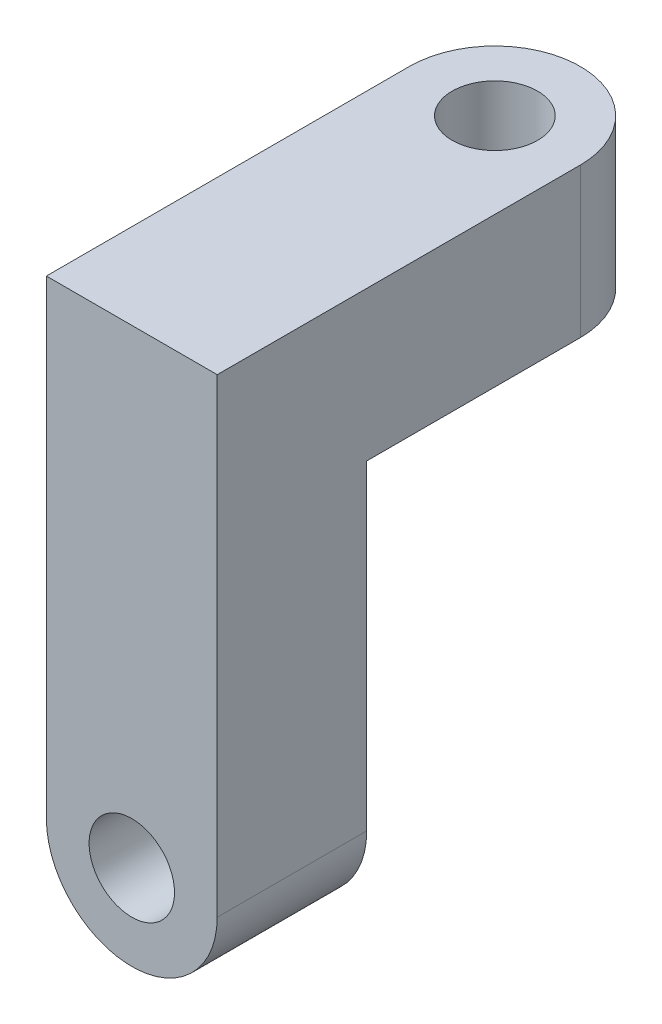
ISO-10303-21;
HEADER;
FILE_DESCRIPTION(('STEP AP214'),'2;1');
FILE_NAME('part.step','',(''),(''),'','','');
FILE_SCHEMA(('AUTOMOTIVE_DESIGN { 1 0 10303 214 1 1 1 1 }'));
ENDSEC;
DATA;
#1=APPLICATION_CONTEXT('core data for automotive mechanical design processes');
#2=APPLICATION_PROTOCOL_DEFINITION('international standard','automotive_design',2000,#1);
#3=PRODUCT_CONTEXT('',#1,'mechanical');
#4=PRODUCT('Part','Part','',(#3));
#5=PRODUCT_RELATED_PRODUCT_CATEGORY('part','',(#4));
#6=PRODUCT_DEFINITION_FORMATION('','',#4);
#7=PRODUCT_DEFINITION_CONTEXT('part definition',#1,'design');
#8=PRODUCT_DEFINITION('design','',#6,#7);
#9=PRODUCT_DEFINITION_SHAPE('','',#8);
#10=(LENGTH_UNIT() NAMED_UNIT(*) SI_UNIT(.MILLI.,.METRE.));
#11=(NAMED_UNIT(*) PLANE_ANGLE_UNIT() SI_UNIT($,.RADIAN.));
#12=(NAMED_UNIT(*) SI_UNIT($,.STERADIAN.) SOLID_ANGLE_UNIT());
#13=UNCERTAINTY_MEASURE_WITH_UNIT(LENGTH_MEASURE(1.E-05),#10,'distance_accuracy_value','');
#14=(GEOMETRIC_REPRESENTATION_CONTEXT(3) GLOBAL_UNCERTAINTY_ASSIGNED_CONTEXT((#13)) GLOBAL_UNIT_ASSIGNED_CONTEXT((#10,
#11,#12)) REPRESENTATION_CONTEXT('',''));
#15=CARTESIAN_POINT('',(0.,0.,0.));
#16=DIRECTION('',(0.,0.,1.));
#17=DIRECTION('',(1.,0.,0.));
#18=AXIS2_PLACEMENT_3D('',#15,#16,#17);
#19=CARTESIAN_POINT('',(0.,-15.,7.));
#20=DIRECTION('',(0.,0.,1.));
#21=DIRECTION('',(1.,0.,0.));
#22=AXIS2_PLACEMENT_3D('',#19,#20,#21);
#23=PLANE('',#22);
#24=CARTESIAN_POINT('',(0.,-15.,7.));
#25=DIRECTION('',(0.,0.,1.));
#26=DIRECTION('',(1.,0.,0.));
#27=AXIS2_PLACEMENT_3D('',#24,#25,#26);
#28=CIRCLE('',#27,2.);
#29=CARTESIAN_POINT('',(2.,-15.,7.));
#30=VERTEX_POINT('',#29);
#31=EDGE_CURVE('E153',#30,#30,#28,.T.);
#32=ORIENTED_EDGE('',*,*,#31,.F.);
#33=EDGE_LOOP('',(#32));
#34=FACE_BOUND('',#33,.T.);
#35=CARTESIAN_POINT('',(0.,-15.,7.));
#36=DIRECTION('',(0.,0.,1.));
#37=DIRECTION('',(1.,0.,0.));
#38=AXIS2_PLACEMENT_3D('',#35,#36,#37);
#39=CIRCLE('',#38,4.);
#40=CARTESIAN_POINT('',(-4.,-15.,7.));
#41=VERTEX_POINT('',#40);
#42=CARTESIAN_POINT('',(4.,-15.,7.));
#43=VERTEX_POINT('',#42);
#44=EDGE_CURVE('E80',#41,#43,#39,.T.);
#45=ORIENTED_EDGE('',*,*,#44,.T.);
#46=DIRECTION('',(0.,1.,0.));
#47=VECTOR('',#46,1.);
#48=CARTESIAN_POINT('',(4.,0.,7.));
#49=LINE('',#48,#47);
#50=CARTESIAN_POINT('',(4.,7.,7.));
#51=VERTEX_POINT('',#50);
#52=EDGE_CURVE('E145',#43,#51,#49,.T.);
#53=ORIENTED_EDGE('',*,*,#52,.T.);
#54=DIRECTION('',(1.,0.,0.));
#55=VECTOR('',#54,1.);
#56=CARTESIAN_POINT('',(0.,7.,7.));
#57=LINE('',#56,#55);
#58=CARTESIAN_POINT('',(-4.,7.,7.));
#59=VERTEX_POINT('',#58);
#60=EDGE_CURVE('E134',#59,#51,#57,.T.);
#61=ORIENTED_EDGE('',*,*,#60,.F.);
#62=DIRECTION('',(0.,-1.,0.));
#63=VECTOR('',#62,1.);
#64=CARTESIAN_POINT('',(-4.,-15.,7.));
#65=LINE('',#64,#63);
#66=EDGE_CURVE('E51',#59,#41,#65,.T.);
#67=ORIENTED_EDGE('',*,*,#66,.T.);
#68=EDGE_LOOP('',(#45,#53,#61,#67));
#69=FACE_BOUND('',#68,.T.);
#70=ADVANCED_FACE('F33',(#34,#69),#23,.T.);
#71=CARTESIAN_POINT('',(0.,-15.,0.));
#72=DIRECTION('',(0.,0.,1.));
#73=DIRECTION('',(1.,0.,0.));
#74=AXIS2_PLACEMENT_3D('',#71,#72,#73);
#75=PLANE('',#74);
#76=CARTESIAN_POINT('',(0.,-15.,0.));
#77=DIRECTION('',(0.,0.,1.));
#78=DIRECTION('',(1.,0.,0.));
#79=AXIS2_PLACEMENT_3D('',#76,#77,#78);
#80=CIRCLE('',#79,2.);
#81=CARTESIAN_POINT('',(2.,-15.,0.));
#82=VERTEX_POINT('',#81);
#83=EDGE_CURVE('E37',#82,#82,#80,.T.);
#84=ORIENTED_EDGE('',*,*,#83,.T.);
#85=EDGE_LOOP('',(#84));
#86=FACE_BOUND('',#85,.T.);
#87=CARTESIAN_POINT('',(0.,-15.,0.));
#88=DIRECTION('',(0.,0.,1.));
#89=DIRECTION('',(1.,0.,0.));
#90=AXIS2_PLACEMENT_3D('',#87,#88,#89);
#91=CIRCLE('',#90,4.);
#92=CARTESIAN_POINT('',(-4.,-15.,0.));
#93=VERTEX_POINT('',#92);
#94=CARTESIAN_POINT('',(4.,-15.,0.));
#95=VERTEX_POINT('',#94);
#96=EDGE_CURVE('E86',#93,#95,#91,.T.);
#97=ORIENTED_EDGE('',*,*,#96,.F.);
#98=DIRECTION('',(0.,-1.,0.));
#99=VECTOR('',#98,1.);
#100=CARTESIAN_POINT('',(-4.,-15.,0.));
#101=LINE('',#100,#99);
#102=CARTESIAN_POINT('',(-4.,0.,0.));
#103=VERTEX_POINT('',#102);
#104=EDGE_CURVE('E70',#103,#93,#101,.T.);
#105=ORIENTED_EDGE('',*,*,#104,.F.);
#106=DIRECTION('',(-1.,0.,0.));
#107=VECTOR('',#106,1.);
#108=CARTESIAN_POINT('',(-4.,0.,0.));
#109=LINE('',#108,#107);
#110=CARTESIAN_POINT('',(4.,0.,0.));
#111=VERTEX_POINT('',#110);
#112=EDGE_CURVE('E81',#111,#103,#109,.T.);
#113=ORIENTED_EDGE('',*,*,#112,.F.);
#114=DIRECTION('',(0.,1.,0.));
#115=VECTOR('',#114,1.);
#116=CARTESIAN_POINT('',(4.,0.,0.));
#117=LINE('',#116,#115);
#118=EDGE_CURVE('E64',#95,#111,#117,.T.);
#119=ORIENTED_EDGE('',*,*,#118,.F.);
#120=EDGE_LOOP('',(#97,#105,#113,#119));
#121=FACE_BOUND('',#120,.T.);
#122=ADVANCED_FACE('F88',(#86,#121),#75,.F.);
#123=CARTESIAN_POINT('',(0.,-15.,7.));
#124=DIRECTION('',(0.,0.,-1.));
#125=DIRECTION('',(-1.,0.,0.));
#126=AXIS2_PLACEMENT_3D('',#123,#124,#125);
#127=CYLINDRICAL_SURFACE('',#126,4.);
#128=ORIENTED_EDGE('',*,*,#96,.T.);
#129=DIRECTION('',(0.,0.,-1.));
#130=VECTOR('',#129,1.);
#131=CARTESIAN_POINT('',(4.,-15.,7.));
#132=LINE('',#131,#130);
#133=EDGE_CURVE('E11',#43,#95,#132,.T.);
#134=ORIENTED_EDGE('',*,*,#133,.F.);
#135=ORIENTED_EDGE('',*,*,#44,.F.);
#136=DIRECTION('',(0.,0.,-1.));
#137=VECTOR('',#136,1.);
#138=CARTESIAN_POINT('',(-4.,-15.,7.));
#139=LINE('',#138,#137);
#140=EDGE_CURVE('E43',#41,#93,#139,.T.);
#141=ORIENTED_EDGE('',*,*,#140,.T.);
#142=EDGE_LOOP('',(#128,#134,#135,#141));
#143=FACE_BOUND('',#142,.T.);
#144=ADVANCED_FACE('F35',(#143),#127,.T.);
#145=CARTESIAN_POINT('',(4.,0.,7.));
#146=DIRECTION('',(-1.,0.,0.));
#147=DIRECTION('',(0.,0.,1.));
#148=AXIS2_PLACEMENT_3D('',#145,#146,#147);
#149=PLANE('',#148);
#150=ORIENTED_EDGE('',*,*,#118,.T.);
#151=DIRECTION('',(0.,0.,-1.));
#152=VECTOR('',#151,1.);
#153=CARTESIAN_POINT('',(4.,0.,0.));
#154=LINE('',#153,#152);
#155=CARTESIAN_POINT('',(4.,0.,-10.));
#156=VERTEX_POINT('',#155);
#157=EDGE_CURVE('E103',#111,#156,#154,.T.);
#158=ORIENTED_EDGE('',*,*,#157,.T.);
#159=DIRECTION('',(0.,-1.,0.));
#160=VECTOR('',#159,1.);
#161=CARTESIAN_POINT('',(4.,7.,-10.));
#162=LINE('',#161,#160);
#163=CARTESIAN_POINT('',(4.,7.,-10.));
#164=VERTEX_POINT('',#163);
#165=EDGE_CURVE('E89',#164,#156,#162,.T.);
#166=ORIENTED_EDGE('',*,*,#165,.F.);
#167=DIRECTION('',(0.,0.,-1.));
#168=VECTOR('',#167,1.);
#169=CARTESIAN_POINT('',(4.,7.,0.));
#170=LINE('',#169,#168);
#171=EDGE_CURVE('E129',#51,#164,#170,.T.);
#172=ORIENTED_EDGE('',*,*,#171,.F.);
#173=ORIENTED_EDGE('',*,*,#52,.F.);
#174=ORIENTED_EDGE('',*,*,#133,.T.);
#175=EDGE_LOOP('',(#150,#158,#166,#172,#173,#174));
#176=FACE_BOUND('',#175,.T.);
#177=ADVANCED_FACE('F136',(#176),#149,.F.);
#178=CARTESIAN_POINT('',(-4.,-15.,7.));
#179=DIRECTION('',(1.,0.,0.));
#180=DIRECTION('',(0.,0.,-1.));
#181=AXIS2_PLACEMENT_3D('',#178,#179,#180);
#182=PLANE('',#181);
#183=ORIENTED_EDGE('',*,*,#104,.T.);
#184=ORIENTED_EDGE('',*,*,#140,.F.);
#185=ORIENTED_EDGE('',*,*,#66,.F.);
#186=DIRECTION('',(0.,0.,1.));
#187=VECTOR('',#186,1.);
#188=CARTESIAN_POINT('',(-4.,7.,0.));
#189=LINE('',#188,#187);
#190=CARTESIAN_POINT('',(-4.,7.,-10.));
#191=VERTEX_POINT('',#190);
#192=EDGE_CURVE('E128',#191,#59,#189,.T.);
#193=ORIENTED_EDGE('',*,*,#192,.F.);
#194=DIRECTION('',(0.,-1.,0.));
#195=VECTOR('',#194,1.);
#196=CARTESIAN_POINT('',(-4.,7.,-10.));
#197=LINE('',#196,#195);
#198=CARTESIAN_POINT('',(-4.,0.,-10.));
#199=VERTEX_POINT('',#198);
#200=EDGE_CURVE('E93',#191,#199,#197,.T.);
#201=ORIENTED_EDGE('',*,*,#200,.T.);
#202=DIRECTION('',(0.,0.,1.));
#203=VECTOR('',#202,1.);
#204=CARTESIAN_POINT('',(-4.,0.,0.));
#205=LINE('',#204,#203);
#206=EDGE_CURVE('E76',#199,#103,#205,.T.);
#207=ORIENTED_EDGE('',*,*,#206,.T.);
#208=EDGE_LOOP('',(#183,#184,#185,#193,#201,#207));
#209=FACE_BOUND('',#208,.T.);
#210=ADVANCED_FACE('F72',(#209),#182,.F.);
#211=CARTESIAN_POINT('',(0.,0.,0.));
#212=DIRECTION('',(0.,1.,0.));
#213=DIRECTION('',(0.,0.,1.));
#214=AXIS2_PLACEMENT_3D('',#211,#212,#213);
#215=PLANE('',#214);
#216=CARTESIAN_POINT('',(0.,0.,-10.));
#217=DIRECTION('',(0.,1.,0.));
#218=DIRECTION('',(0.,0.,1.));
#219=AXIS2_PLACEMENT_3D('',#216,#217,#218);
#220=CIRCLE('',#219,2.);
#221=CARTESIAN_POINT('',(0.,0.,-8.));
#222=VERTEX_POINT('',#221);
#223=EDGE_CURVE('E138',#222,#222,#220,.T.);
#224=ORIENTED_EDGE('',*,*,#223,.T.);
#225=EDGE_LOOP('',(#224));
#226=FACE_BOUND('',#225,.T.);
#227=ORIENTED_EDGE('',*,*,#157,.F.);
#228=ORIENTED_EDGE('',*,*,#112,.T.);
#229=ORIENTED_EDGE('',*,*,#206,.F.);
#230=CARTESIAN_POINT('',(0.,0.,-10.));
#231=DIRECTION('',(0.,1.,0.));
#232=DIRECTION('',(0.,0.,1.));
#233=AXIS2_PLACEMENT_3D('',#230,#231,#232);
#234=CIRCLE('',#233,4.);
#235=EDGE_CURVE('E137',#156,#199,#234,.T.);
#236=ORIENTED_EDGE('',*,*,#235,.F.);
#237=EDGE_LOOP('',(#227,#228,#229,#236));
#238=FACE_BOUND('',#237,.T.);
#239=ADVANCED_FACE('F100',(#226,#238),#215,.F.);
#240=CARTESIAN_POINT('',(0.,7.,-10.));
#241=DIRECTION('',(0.,-1.,0.));
#242=DIRECTION('',(0.,0.,-1.));
#243=AXIS2_PLACEMENT_3D('',#240,#241,#242);
#244=CYLINDRICAL_SURFACE('',#243,4.);
#245=ORIENTED_EDGE('',*,*,#235,.T.);
#246=ORIENTED_EDGE('',*,*,#200,.F.);
#247=CARTESIAN_POINT('',(0.,7.,-10.));
#248=DIRECTION('',(0.,1.,0.));
#249=DIRECTION('',(0.,0.,1.));
#250=AXIS2_PLACEMENT_3D('',#247,#248,#249);
#251=CIRCLE('',#250,4.);
#252=EDGE_CURVE('E121',#164,#191,#251,.T.);
#253=ORIENTED_EDGE('',*,*,#252,.F.);
#254=ORIENTED_EDGE('',*,*,#165,.T.);
#255=EDGE_LOOP('',(#245,#246,#253,#254));
#256=FACE_BOUND('',#255,.T.);
#257=ADVANCED_FACE('F123',(#256),#244,.T.);
#258=CARTESIAN_POINT('',(0.,7.,0.));
#259=DIRECTION('',(0.,1.,0.));
#260=DIRECTION('',(0.,0.,1.));
#261=AXIS2_PLACEMENT_3D('',#258,#259,#260);
#262=PLANE('',#261);
#263=CARTESIAN_POINT('',(0.,7.,-10.));
#264=DIRECTION('',(0.,1.,0.));
#265=DIRECTION('',(0.,0.,1.));
#266=AXIS2_PLACEMENT_3D('',#263,#264,#265);
#267=CIRCLE('',#266,2.);
#268=CARTESIAN_POINT('',(0.,7.,-8.));
#269=VERTEX_POINT('',#268);
#270=EDGE_CURVE('E150',#269,#269,#267,.T.);
#271=ORIENTED_EDGE('',*,*,#270,.F.);
#272=EDGE_LOOP('',(#271));
#273=FACE_BOUND('',#272,.T.);
#274=ORIENTED_EDGE('',*,*,#171,.T.);
#275=ORIENTED_EDGE('',*,*,#252,.T.);
#276=ORIENTED_EDGE('',*,*,#192,.T.);
#277=ORIENTED_EDGE('',*,*,#60,.T.);
#278=EDGE_LOOP('',(#274,#275,#276,#277));
#279=FACE_BOUND('',#278,.T.);
#280=ADVANCED_FACE('F133',(#273,#279),#262,.T.);
#281=CARTESIAN_POINT('',(0.,-3.,-10.));
#282=DIRECTION('',(0.,1.,0.));
#283=DIRECTION('',(0.,0.,1.));
#284=AXIS2_PLACEMENT_3D('',#281,#282,#283);
#285=CYLINDRICAL_SURFACE('',#284,2.);
#286=ORIENTED_EDGE('',*,*,#270,.T.);
#287=EDGE_LOOP('',(#286));
#288=FACE_BOUND('',#287,.T.);
#289=ORIENTED_EDGE('',*,*,#223,.F.);
#290=EDGE_LOOP('',(#289));
#291=FACE_BOUND('',#290,.T.);
#292=ADVANCED_FACE('F163',(#288,#291),#285,.F.);
#293=CARTESIAN_POINT('',(0.,-15.,-3.));
#294=DIRECTION('',(0.,0.,1.));
#295=DIRECTION('',(1.,0.,0.));
#296=AXIS2_PLACEMENT_3D('',#293,#294,#295);
#297=CYLINDRICAL_SURFACE('',#296,2.);
#298=ORIENTED_EDGE('',*,*,#31,.T.);
#299=EDGE_LOOP('',(#298));
#300=FACE_BOUND('',#299,.T.);
#301=ORIENTED_EDGE('',*,*,#83,.F.);
#302=EDGE_LOOP('',(#301));
#303=FACE_BOUND('',#302,.T.);
#304=ADVANCED_FACE('F161',(#300,#303),#297,.F.);
#305=CLOSED_SHELL('',(#70,#122,#144,#177,#210,#239,#257,#280,#292,#304));
#306=MANIFOLD_SOLID_BREP('B2',#305);
#307=ADVANCED_BREP_SHAPE_REPRESENTATION('',(#18,#306),#14);
#308=SHAPE_DEFINITION_REPRESENTATION(#9,#307);
ENDSEC;
END-ISO-10303-21;
